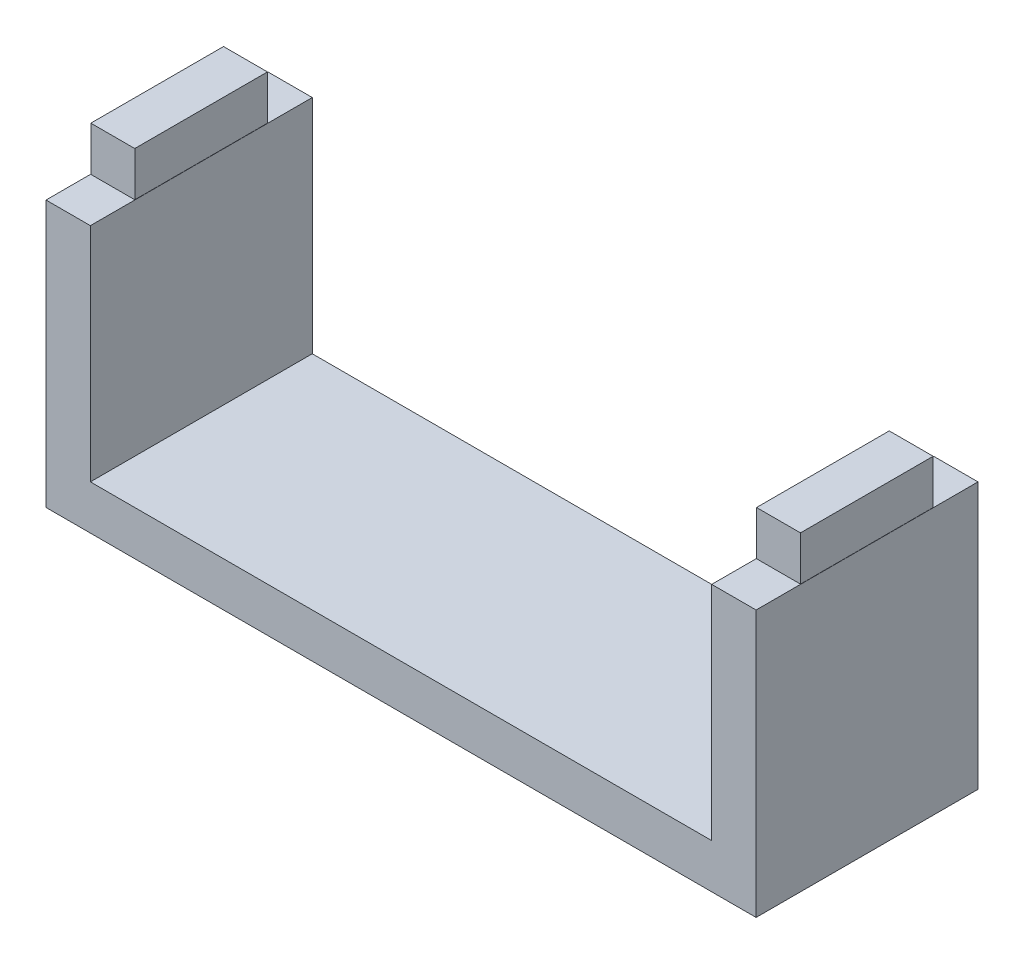
ISO-10303-21;
HEADER;
FILE_DESCRIPTION(('STEP AP214'),'2;1');
FILE_NAME('part.step','',(''),(''),'','','');
FILE_SCHEMA(('AUTOMOTIVE_DESIGN { 1 0 10303 214 1 1 1 1 }'));
ENDSEC;
DATA;
#1=APPLICATION_CONTEXT('core data for automotive mechanical design processes');
#2=APPLICATION_PROTOCOL_DEFINITION('international standard','automotive_design',2000,#1);
#3=PRODUCT_CONTEXT('',#1,'mechanical');
#4=PRODUCT('Part','Part','',(#3));
#5=PRODUCT_RELATED_PRODUCT_CATEGORY('part','',(#4));
#6=PRODUCT_DEFINITION_FORMATION('','',#4);
#7=PRODUCT_DEFINITION_CONTEXT('part definition',#1,'design');
#8=PRODUCT_DEFINITION('design','',#6,#7);
#9=PRODUCT_DEFINITION_SHAPE('','',#8);
#10=(LENGTH_UNIT() NAMED_UNIT(*) SI_UNIT(.MILLI.,.METRE.));
#11=(NAMED_UNIT(*) PLANE_ANGLE_UNIT() SI_UNIT($,.RADIAN.));
#12=(NAMED_UNIT(*) SI_UNIT($,.STERADIAN.) SOLID_ANGLE_UNIT());
#13=UNCERTAINTY_MEASURE_WITH_UNIT(LENGTH_MEASURE(1.E-05),#10,'distance_accuracy_value','');
#14=(GEOMETRIC_REPRESENTATION_CONTEXT(3) GLOBAL_UNCERTAINTY_ASSIGNED_CONTEXT((#13)) GLOBAL_UNIT_ASSIGNED_CONTEXT((#10,
#11,#12)) REPRESENTATION_CONTEXT('',''));
#15=CARTESIAN_POINT('',(0.,0.,0.));
#16=DIRECTION('',(0.,0.,1.));
#17=DIRECTION('',(1.,0.,0.));
#18=AXIS2_PLACEMENT_3D('',#15,#16,#17);
#19=CARTESIAN_POINT('',(0.,60.,0.));
#20=DIRECTION('',(0.,-1.,0.));
#21=DIRECTION('',(0.,0.,-1.));
#22=AXIS2_PLACEMENT_3D('',#19,#20,#21);
#23=PLANE('',#22);
#24=DIRECTION('',(0.,0.,-1.));
#25=VECTOR('',#24,1.);
#26=CARTESIAN_POINT('',(80.0000000000002,60.,-25.));
#27=LINE('',#26,#25);
#28=CARTESIAN_POINT('',(80.0000000000002,60.,25.));
#29=VERTEX_POINT('',#28);
#30=CARTESIAN_POINT('',(80.0000000000002,60.,-25.));
#31=VERTEX_POINT('',#30);
#32=EDGE_CURVE('E225',#29,#31,#27,.T.);
#33=ORIENTED_EDGE('',*,*,#32,.T.);
#34=DIRECTION('',(-1.,0.,0.));
#35=VECTOR('',#34,1.);
#36=CARTESIAN_POINT('',(80.0000000000002,60.,-25.));
#37=LINE('',#36,#35);
#38=CARTESIAN_POINT('',(70.0000000000002,60.,-25.));
#39=VERTEX_POINT('',#38);
#40=EDGE_CURVE('E229',#31,#39,#37,.T.);
#41=ORIENTED_EDGE('',*,*,#40,.T.);
#42=DIRECTION('',(0.,0.,1.));
#43=VECTOR('',#42,1.);
#44=CARTESIAN_POINT('',(70.0000000000002,60.,-25.));
#45=LINE('',#44,#43);
#46=CARTESIAN_POINT('',(70.0000000000001,60.,25.));
#47=VERTEX_POINT('',#46);
#48=EDGE_CURVE('E232',#39,#47,#45,.T.);
#49=ORIENTED_EDGE('',*,*,#48,.T.);
#50=DIRECTION('',(1.,0.,0.));
#51=VECTOR('',#50,1.);
#52=CARTESIAN_POINT('',(80.0000000000002,60.,25.));
#53=LINE('',#52,#51);
#54=EDGE_CURVE('E235',#47,#29,#53,.T.);
#55=ORIENTED_EDGE('',*,*,#54,.T.);
#56=EDGE_LOOP('',(#33,#41,#49,#55));
#57=FACE_BOUND('',#56,.T.);
#58=DIRECTION('',(0.,0.,1.));
#59=VECTOR('',#58,1.);
#60=CARTESIAN_POINT('',(70.0499999999999,60.,14.9499999999999));
#61=LINE('',#60,#59);
#62=CARTESIAN_POINT('',(70.0499999999999,60.,-14.95));
#63=VERTEX_POINT('',#62);
#64=CARTESIAN_POINT('',(70.0499999999999,60.,14.9499999999999));
#65=VERTEX_POINT('',#64);
#66=EDGE_CURVE('E175',#63,#65,#61,.T.);
#67=ORIENTED_EDGE('',*,*,#66,.F.);
#68=DIRECTION('',(-1.,0.,0.));
#69=VECTOR('',#68,1.);
#70=CARTESIAN_POINT('',(70.0499999999999,60.,-14.95));
#71=LINE('',#70,#69);
#72=CARTESIAN_POINT('',(79.9499999999998,60.,-14.95));
#73=VERTEX_POINT('',#72);
#74=EDGE_CURVE('E172',#73,#63,#71,.T.);
#75=ORIENTED_EDGE('',*,*,#74,.F.);
#76=DIRECTION('',(0.,0.,-1.));
#77=VECTOR('',#76,1.);
#78=CARTESIAN_POINT('',(79.9499999999998,60.,14.9499999999999));
#79=LINE('',#78,#77);
#80=CARTESIAN_POINT('',(79.9499999999998,60.,14.9499999999999));
#81=VERTEX_POINT('',#80);
#82=EDGE_CURVE('E60',#81,#73,#79,.T.);
#83=ORIENTED_EDGE('',*,*,#82,.F.);
#84=DIRECTION('',(1.,0.,0.));
#85=VECTOR('',#84,1.);
#86=CARTESIAN_POINT('',(70.0499999999999,60.,14.9499999999999));
#87=LINE('',#86,#85);
#88=EDGE_CURVE('E55',#65,#81,#87,.T.);
#89=ORIENTED_EDGE('',*,*,#88,.F.);
#90=EDGE_LOOP('',(#67,#75,#83,#89));
#91=FACE_BOUND('',#90,.T.);
#92=ADVANCED_FACE('F39',(#57,#91),#23,.F.);
#93=CARTESIAN_POINT('',(0.,60.,0.));
#94=DIRECTION('',(0.,1.,0.));
#95=DIRECTION('',(0.,0.,1.));
#96=AXIS2_PLACEMENT_3D('',#93,#94,#95);
#97=PLANE('',#96);
#98=DIRECTION('',(0.,0.,1.));
#99=VECTOR('',#98,1.);
#100=CARTESIAN_POINT('',(-79.9999999999998,60.,-25.));
#101=LINE('',#100,#99);
#102=CARTESIAN_POINT('',(-79.9999999999998,60.,-25.));
#103=VERTEX_POINT('',#102);
#104=CARTESIAN_POINT('',(-79.9999999999998,60.,25.));
#105=VERTEX_POINT('',#104);
#106=EDGE_CURVE('E251',#103,#105,#101,.T.);
#107=ORIENTED_EDGE('',*,*,#106,.T.);
#108=DIRECTION('',(1.,0.,0.));
#109=VECTOR('',#108,1.);
#110=CARTESIAN_POINT('',(-79.9999999999998,60.,25.));
#111=LINE('',#110,#109);
#112=CARTESIAN_POINT('',(-69.9999999999998,60.,25.));
#113=VERTEX_POINT('',#112);
#114=EDGE_CURVE('E255',#105,#113,#111,.T.);
#115=ORIENTED_EDGE('',*,*,#114,.T.);
#116=DIRECTION('',(0.,0.,-1.));
#117=VECTOR('',#116,1.);
#118=CARTESIAN_POINT('',(-69.9999999999999,60.,-25.));
#119=LINE('',#118,#117);
#120=CARTESIAN_POINT('',(-69.9999999999999,60.,-25.));
#121=VERTEX_POINT('',#120);
#122=EDGE_CURVE('E258',#113,#121,#119,.T.);
#123=ORIENTED_EDGE('',*,*,#122,.T.);
#124=DIRECTION('',(-1.,0.,0.));
#125=VECTOR('',#124,1.);
#126=CARTESIAN_POINT('',(-79.9999999999998,60.,-25.));
#127=LINE('',#126,#125);
#128=EDGE_CURVE('E261',#121,#103,#127,.T.);
#129=ORIENTED_EDGE('',*,*,#128,.T.);
#130=EDGE_LOOP('',(#107,#115,#123,#129));
#131=FACE_BOUND('',#130,.T.);
#132=DIRECTION('',(-1.,0.,0.));
#133=VECTOR('',#132,1.);
#134=CARTESIAN_POINT('',(-70.0499999999999,60.,-14.95));
#135=LINE('',#134,#133);
#136=CARTESIAN_POINT('',(-70.0499999999999,60.,-14.95));
#137=VERTEX_POINT('',#136);
#138=CARTESIAN_POINT('',(-79.9499999999998,60.,-14.95));
#139=VERTEX_POINT('',#138);
#140=EDGE_CURVE('E182',#137,#139,#135,.T.);
#141=ORIENTED_EDGE('',*,*,#140,.F.);
#142=DIRECTION('',(0.,0.,-1.));
#143=VECTOR('',#142,1.);
#144=CARTESIAN_POINT('',(-70.0499999999999,60.,14.95));
#145=LINE('',#144,#143);
#146=CARTESIAN_POINT('',(-70.0499999999999,60.,14.95));
#147=VERTEX_POINT('',#146);
#148=EDGE_CURVE('E177',#147,#137,#145,.T.);
#149=ORIENTED_EDGE('',*,*,#148,.F.);
#150=DIRECTION('',(1.,0.,0.));
#151=VECTOR('',#150,1.);
#152=CARTESIAN_POINT('',(-70.0499999999999,60.,14.95));
#153=LINE('',#152,#151);
#154=CARTESIAN_POINT('',(-79.9499999999998,60.,14.95));
#155=VERTEX_POINT('',#154);
#156=EDGE_CURVE('E193',#155,#147,#153,.T.);
#157=ORIENTED_EDGE('',*,*,#156,.F.);
#158=DIRECTION('',(0.,0.,1.));
#159=VECTOR('',#158,1.);
#160=CARTESIAN_POINT('',(-79.9499999999998,60.,14.95));
#161=LINE('',#160,#159);
#162=EDGE_CURVE('E205',#139,#155,#161,.T.);
#163=ORIENTED_EDGE('',*,*,#162,.F.);
#164=EDGE_LOOP('',(#141,#149,#157,#163));
#165=FACE_BOUND('',#164,.T.);
#166=ADVANCED_FACE('F322',(#131,#165),#97,.T.);
#167=CARTESIAN_POINT('',(0.,10.,0.));
#168=DIRECTION('',(0.,1.,0.));
#169=DIRECTION('',(0.,0.,1.));
#170=AXIS2_PLACEMENT_3D('',#167,#168,#169);
#171=PLANE('',#170);
#172=DIRECTION('',(1.,0.,0.));
#173=VECTOR('',#172,1.);
#174=CARTESIAN_POINT('',(80.0000000000002,10.,25.));
#175=LINE('',#174,#173);
#176=CARTESIAN_POINT('',(-69.9999999999998,10.,25.));
#177=VERTEX_POINT('',#176);
#178=CARTESIAN_POINT('',(70.0000000000001,10.,25.));
#179=VERTEX_POINT('',#178);
#180=EDGE_CURVE('E277',#177,#179,#175,.T.);
#181=ORIENTED_EDGE('',*,*,#180,.T.);
#182=DIRECTION('',(0.,0.,1.));
#183=VECTOR('',#182,1.);
#184=CARTESIAN_POINT('',(70.0000000000002,10.,-25.));
#185=LINE('',#184,#183);
#186=CARTESIAN_POINT('',(70.0000000000001,10.,-25.));
#187=VERTEX_POINT('',#186);
#188=EDGE_CURVE('E224',#187,#179,#185,.T.);
#189=ORIENTED_EDGE('',*,*,#188,.F.);
#190=DIRECTION('',(-1.,0.,0.));
#191=VECTOR('',#190,1.);
#192=CARTESIAN_POINT('',(80.0000000000002,10.,-25.));
#193=LINE('',#192,#191);
#194=CARTESIAN_POINT('',(-69.9999999999999,10.,-25.));
#195=VERTEX_POINT('',#194);
#196=EDGE_CURVE('E280',#187,#195,#193,.T.);
#197=ORIENTED_EDGE('',*,*,#196,.T.);
#198=DIRECTION('',(0.,0.,-1.));
#199=VECTOR('',#198,1.);
#200=CARTESIAN_POINT('',(-69.9999999999999,10.,-25.));
#201=LINE('',#200,#199);
#202=EDGE_CURVE('E250',#177,#195,#201,.T.);
#203=ORIENTED_EDGE('',*,*,#202,.F.);
#204=EDGE_LOOP('',(#181,#189,#197,#203));
#205=FACE_BOUND('',#204,.T.);
#206=ADVANCED_FACE('F333',(#205),#171,.T.);
#207=CARTESIAN_POINT('',(-79.9999999999998,10.,25.));
#208=DIRECTION('',(1.,0.,0.));
#209=DIRECTION('',(0.,0.,-1.));
#210=AXIS2_PLACEMENT_3D('',#207,#208,#209);
#211=PLANE('',#210);
#212=DIRECTION('',(0.,0.,1.));
#213=VECTOR('',#212,1.);
#214=CARTESIAN_POINT('',(-79.9999999999998,0.,25.));
#215=LINE('',#214,#213);
#216=CARTESIAN_POINT('',(-79.9999999999998,0.,-25.));
#217=VERTEX_POINT('',#216);
#218=CARTESIAN_POINT('',(-79.9999999999998,0.,25.));
#219=VERTEX_POINT('',#218);
#220=EDGE_CURVE('E276',#217,#219,#215,.T.);
#221=ORIENTED_EDGE('',*,*,#220,.T.);
#222=DIRECTION('',(0.,-1.,0.));
#223=VECTOR('',#222,1.);
#224=CARTESIAN_POINT('',(-79.9999999999998,10.,25.));
#225=LINE('',#224,#223);
#226=EDGE_CURVE('E11',#105,#219,#225,.T.);
#227=ORIENTED_EDGE('',*,*,#226,.F.);
#228=ORIENTED_EDGE('',*,*,#106,.F.);
#229=DIRECTION('',(0.,-1.,0.));
#230=VECTOR('',#229,1.);
#231=CARTESIAN_POINT('',(-79.9999999999998,10.,-25.));
#232=LINE('',#231,#230);
#233=EDGE_CURVE('E284',#103,#217,#232,.T.);
#234=ORIENTED_EDGE('',*,*,#233,.T.);
#235=EDGE_LOOP('',(#221,#227,#228,#234));
#236=FACE_BOUND('',#235,.T.);
#237=ADVANCED_FACE('F41',(#236),#211,.F.);
#238=CARTESIAN_POINT('',(80.0000000000002,10.,25.));
#239=DIRECTION('',(0.,0.,-1.));
#240=DIRECTION('',(-1.,0.,0.));
#241=AXIS2_PLACEMENT_3D('',#238,#239,#240);
#242=PLANE('',#241);
#243=DIRECTION('',(1.,0.,0.));
#244=VECTOR('',#243,1.);
#245=CARTESIAN_POINT('',(80.0000000000002,0.,25.));
#246=LINE('',#245,#244);
#247=CARTESIAN_POINT('',(80.0000000000002,0.,25.));
#248=VERTEX_POINT('',#247);
#249=EDGE_CURVE('E288',#219,#248,#246,.T.);
#250=ORIENTED_EDGE('',*,*,#249,.T.);
#251=DIRECTION('',(0.,-1.,0.));
#252=VECTOR('',#251,1.);
#253=CARTESIAN_POINT('',(80.0000000000002,10.,25.));
#254=LINE('',#253,#252);
#255=EDGE_CURVE('E48',#29,#248,#254,.T.);
#256=ORIENTED_EDGE('',*,*,#255,.F.);
#257=ORIENTED_EDGE('',*,*,#54,.F.);
#258=DIRECTION('',(0.,-1.,0.));
#259=VECTOR('',#258,1.);
#260=CARTESIAN_POINT('',(70.0000000000001,60.,25.));
#261=LINE('',#260,#259);
#262=EDGE_CURVE('E239',#47,#179,#261,.T.);
#263=ORIENTED_EDGE('',*,*,#262,.T.);
#264=ORIENTED_EDGE('',*,*,#180,.F.);
#265=DIRECTION('',(0.,-1.,0.));
#266=VECTOR('',#265,1.);
#267=CARTESIAN_POINT('',(-69.9999999999998,60.,25.));
#268=LINE('',#267,#266);
#269=EDGE_CURVE('E272',#113,#177,#268,.T.);
#270=ORIENTED_EDGE('',*,*,#269,.F.);
#271=ORIENTED_EDGE('',*,*,#114,.F.);
#272=ORIENTED_EDGE('',*,*,#226,.T.);
#273=EDGE_LOOP('',(#250,#256,#257,#263,#264,#270,#271,#272));
#274=FACE_BOUND('',#273,.T.);
#275=ADVANCED_FACE('F334',(#274),#242,.F.);
#276=CARTESIAN_POINT('',(80.0000000000002,10.,25.));
#277=DIRECTION('',(-1.,0.,0.));
#278=DIRECTION('',(0.,0.,1.));
#279=AXIS2_PLACEMENT_3D('',#276,#277,#278);
#280=PLANE('',#279);
#281=DIRECTION('',(0.,0.,-1.));
#282=VECTOR('',#281,1.);
#283=CARTESIAN_POINT('',(80.0000000000002,0.,25.));
#284=LINE('',#283,#282);
#285=CARTESIAN_POINT('',(80.0000000000002,0.,-25.));
#286=VERTEX_POINT('',#285);
#287=EDGE_CURVE('E291',#248,#286,#284,.T.);
#288=ORIENTED_EDGE('',*,*,#287,.T.);
#289=DIRECTION('',(0.,-1.,0.));
#290=VECTOR('',#289,1.);
#291=CARTESIAN_POINT('',(80.0000000000002,10.,-25.));
#292=LINE('',#291,#290);
#293=EDGE_CURVE('E299',#31,#286,#292,.T.);
#294=ORIENTED_EDGE('',*,*,#293,.F.);
#295=ORIENTED_EDGE('',*,*,#32,.F.);
#296=ORIENTED_EDGE('',*,*,#255,.T.);
#297=EDGE_LOOP('',(#288,#294,#295,#296));
#298=FACE_BOUND('',#297,.T.);
#299=ADVANCED_FACE('F307',(#298),#280,.F.);
#300=CARTESIAN_POINT('',(80.0000000000002,10.,-25.));
#301=DIRECTION('',(0.,0.,1.));
#302=DIRECTION('',(1.,0.,0.));
#303=AXIS2_PLACEMENT_3D('',#300,#301,#302);
#304=PLANE('',#303);
#305=DIRECTION('',(-1.,0.,0.));
#306=VECTOR('',#305,1.);
#307=CARTESIAN_POINT('',(80.0000000000002,0.,-25.));
#308=LINE('',#307,#306);
#309=EDGE_CURVE('E281',#286,#217,#308,.T.);
#310=ORIENTED_EDGE('',*,*,#309,.T.);
#311=ORIENTED_EDGE('',*,*,#233,.F.);
#312=ORIENTED_EDGE('',*,*,#128,.F.);
#313=DIRECTION('',(0.,-1.,0.));
#314=VECTOR('',#313,1.);
#315=CARTESIAN_POINT('',(-69.9999999999999,60.,-25.));
#316=LINE('',#315,#314);
#317=EDGE_CURVE('E265',#121,#195,#316,.T.);
#318=ORIENTED_EDGE('',*,*,#317,.T.);
#319=ORIENTED_EDGE('',*,*,#196,.F.);
#320=DIRECTION('',(0.,-1.,0.));
#321=VECTOR('',#320,1.);
#322=CARTESIAN_POINT('',(70.0000000000002,60.,-25.));
#323=LINE('',#322,#321);
#324=EDGE_CURVE('E246',#39,#187,#323,.T.);
#325=ORIENTED_EDGE('',*,*,#324,.F.);
#326=ORIENTED_EDGE('',*,*,#40,.F.);
#327=ORIENTED_EDGE('',*,*,#293,.T.);
#328=EDGE_LOOP('',(#310,#311,#312,#318,#319,#325,#326,#327));
#329=FACE_BOUND('',#328,.T.);
#330=ADVANCED_FACE('F315',(#329),#304,.F.);
#331=CARTESIAN_POINT('',(0.,0.,0.));
#332=DIRECTION('',(0.,1.,0.));
#333=DIRECTION('',(0.,0.,1.));
#334=AXIS2_PLACEMENT_3D('',#331,#332,#333);
#335=PLANE('',#334);
#336=ORIENTED_EDGE('',*,*,#220,.F.);
#337=ORIENTED_EDGE('',*,*,#309,.F.);
#338=ORIENTED_EDGE('',*,*,#287,.F.);
#339=ORIENTED_EDGE('',*,*,#249,.F.);
#340=EDGE_LOOP('',(#336,#337,#338,#339));
#341=FACE_BOUND('',#340,.T.);
#342=ADVANCED_FACE('F313',(#341),#335,.F.);
#343=CARTESIAN_POINT('',(-69.9999999999999,60.,-25.));
#344=DIRECTION('',(-1.,0.,0.));
#345=DIRECTION('',(0.,0.,1.));
#346=AXIS2_PLACEMENT_3D('',#343,#344,#345);
#347=PLANE('',#346);
#348=ORIENTED_EDGE('',*,*,#202,.T.);
#349=ORIENTED_EDGE('',*,*,#317,.F.);
#350=ORIENTED_EDGE('',*,*,#122,.F.);
#351=ORIENTED_EDGE('',*,*,#269,.T.);
#352=EDGE_LOOP('',(#348,#349,#350,#351));
#353=FACE_BOUND('',#352,.T.);
#354=ADVANCED_FACE('F330',(#353),#347,.F.);
#355=CARTESIAN_POINT('',(70.0000000000002,60.,-25.));
#356=DIRECTION('',(1.,0.,0.));
#357=DIRECTION('',(0.,0.,-1.));
#358=AXIS2_PLACEMENT_3D('',#355,#356,#357);
#359=PLANE('',#358);
#360=ORIENTED_EDGE('',*,*,#188,.T.);
#361=ORIENTED_EDGE('',*,*,#262,.F.);
#362=ORIENTED_EDGE('',*,*,#48,.F.);
#363=ORIENTED_EDGE('',*,*,#324,.T.);
#364=EDGE_LOOP('',(#360,#361,#362,#363));
#365=FACE_BOUND('',#364,.T.);
#366=ADVANCED_FACE('F338',(#365),#359,.F.);
#367=CARTESIAN_POINT('',(-70.0499999999999,70.,14.95));
#368=DIRECTION('',(-1.,0.,0.));
#369=DIRECTION('',(0.,0.,1.));
#370=AXIS2_PLACEMENT_3D('',#367,#368,#369);
#371=PLANE('',#370);
#372=ORIENTED_EDGE('',*,*,#148,.T.);
#373=DIRECTION('',(0.,-1.,0.));
#374=VECTOR('',#373,1.);
#375=CARTESIAN_POINT('',(-70.0499999999999,70.,-14.95));
#376=LINE('',#375,#374);
#377=CARTESIAN_POINT('',(-70.0499999999999,70.,-14.95));
#378=VERTEX_POINT('',#377);
#379=EDGE_CURVE('E221',#378,#137,#376,.T.);
#380=ORIENTED_EDGE('',*,*,#379,.F.);
#381=DIRECTION('',(0.,0.,-1.));
#382=VECTOR('',#381,1.);
#383=CARTESIAN_POINT('',(-70.0499999999999,70.,14.95));
#384=LINE('',#383,#382);
#385=CARTESIAN_POINT('',(-70.0499999999999,70.,14.95));
#386=VERTEX_POINT('',#385);
#387=EDGE_CURVE('E188',#386,#378,#384,.T.);
#388=ORIENTED_EDGE('',*,*,#387,.F.);
#389=DIRECTION('',(0.,-1.,0.));
#390=VECTOR('',#389,1.);
#391=CARTESIAN_POINT('',(-70.0499999999999,70.,14.95));
#392=LINE('',#391,#390);
#393=EDGE_CURVE('E201',#386,#147,#392,.T.);
#394=ORIENTED_EDGE('',*,*,#393,.T.);
#395=EDGE_LOOP('',(#372,#380,#388,#394));
#396=FACE_BOUND('',#395,.T.);
#397=ADVANCED_FACE('F392',(#396),#371,.F.);
#398=CARTESIAN_POINT('',(-70.0499999999999,70.,-14.95));
#399=DIRECTION('',(0.,0.,1.));
#400=DIRECTION('',(1.,0.,0.));
#401=AXIS2_PLACEMENT_3D('',#398,#399,#400);
#402=PLANE('',#401);
#403=ORIENTED_EDGE('',*,*,#140,.T.);
#404=DIRECTION('',(0.,-1.,0.));
#405=VECTOR('',#404,1.);
#406=CARTESIAN_POINT('',(-79.9499999999998,70.,-14.95));
#407=LINE('',#406,#405);
#408=CARTESIAN_POINT('',(-79.9499999999998,70.,-14.95));
#409=VERTEX_POINT('',#408);
#410=EDGE_CURVE('E217',#409,#139,#407,.T.);
#411=ORIENTED_EDGE('',*,*,#410,.F.);
#412=DIRECTION('',(-1.,0.,0.));
#413=VECTOR('',#412,1.);
#414=CARTESIAN_POINT('',(-70.0499999999999,70.,-14.95));
#415=LINE('',#414,#413);
#416=EDGE_CURVE('E192',#378,#409,#415,.T.);
#417=ORIENTED_EDGE('',*,*,#416,.F.);
#418=ORIENTED_EDGE('',*,*,#379,.T.);
#419=EDGE_LOOP('',(#403,#411,#417,#418));
#420=FACE_BOUND('',#419,.T.);
#421=ADVANCED_FACE('F388',(#420),#402,.F.);
#422=CARTESIAN_POINT('',(-79.9499999999998,70.,14.95));
#423=DIRECTION('',(1.,0.,0.));
#424=DIRECTION('',(0.,0.,-1.));
#425=AXIS2_PLACEMENT_3D('',#422,#423,#424);
#426=PLANE('',#425);
#427=ORIENTED_EDGE('',*,*,#162,.T.);
#428=DIRECTION('',(0.,-1.,0.));
#429=VECTOR('',#428,1.);
#430=CARTESIAN_POINT('',(-79.9499999999998,70.,14.95));
#431=LINE('',#430,#429);
#432=CARTESIAN_POINT('',(-79.9499999999998,70.,14.95));
#433=VERTEX_POINT('',#432);
#434=EDGE_CURVE('E214',#433,#155,#431,.T.);
#435=ORIENTED_EDGE('',*,*,#434,.F.);
#436=DIRECTION('',(0.,0.,1.));
#437=VECTOR('',#436,1.);
#438=CARTESIAN_POINT('',(-79.9499999999998,70.,14.95));
#439=LINE('',#438,#437);
#440=EDGE_CURVE('E196',#409,#433,#439,.T.);
#441=ORIENTED_EDGE('',*,*,#440,.F.);
#442=ORIENTED_EDGE('',*,*,#410,.T.);
#443=EDGE_LOOP('',(#427,#435,#441,#442));
#444=FACE_BOUND('',#443,.T.);
#445=ADVANCED_FACE('F384',(#444),#426,.F.);
#446=CARTESIAN_POINT('',(-70.0499999999999,70.,14.95));
#447=DIRECTION('',(0.,0.,-1.));
#448=DIRECTION('',(-1.,0.,0.));
#449=AXIS2_PLACEMENT_3D('',#446,#447,#448);
#450=PLANE('',#449);
#451=ORIENTED_EDGE('',*,*,#156,.T.);
#452=ORIENTED_EDGE('',*,*,#393,.F.);
#453=DIRECTION('',(1.,0.,0.));
#454=VECTOR('',#453,1.);
#455=CARTESIAN_POINT('',(-70.0499999999999,70.,14.95));
#456=LINE('',#455,#454);
#457=EDGE_CURVE('E199',#433,#386,#456,.T.);
#458=ORIENTED_EDGE('',*,*,#457,.F.);
#459=ORIENTED_EDGE('',*,*,#434,.T.);
#460=EDGE_LOOP('',(#451,#452,#458,#459));
#461=FACE_BOUND('',#460,.T.);
#462=ADVANCED_FACE('F380',(#461),#450,.F.);
#463=CARTESIAN_POINT('',(0.,70.,0.));
#464=DIRECTION('',(0.,1.,0.));
#465=DIRECTION('',(0.,0.,1.));
#466=AXIS2_PLACEMENT_3D('',#463,#464,#465);
#467=PLANE('',#466);
#468=ORIENTED_EDGE('',*,*,#387,.T.);
#469=ORIENTED_EDGE('',*,*,#416,.T.);
#470=ORIENTED_EDGE('',*,*,#440,.T.);
#471=ORIENTED_EDGE('',*,*,#457,.T.);
#472=EDGE_LOOP('',(#468,#469,#470,#471));
#473=FACE_BOUND('',#472,.T.);
#474=ADVANCED_FACE('F377',(#473),#467,.T.);
#475=CARTESIAN_POINT('',(70.0499999999999,70.,14.9499999999999));
#476=DIRECTION('',(1.,0.,0.));
#477=DIRECTION('',(0.,0.,-1.));
#478=AXIS2_PLACEMENT_3D('',#475,#476,#477);
#479=PLANE('',#478);
#480=ORIENTED_EDGE('',*,*,#66,.T.);
#481=DIRECTION('',(0.,-1.,0.));
#482=VECTOR('',#481,1.);
#483=CARTESIAN_POINT('',(70.0499999999999,70.,14.9499999999999));
#484=LINE('',#483,#482);
#485=CARTESIAN_POINT('',(70.0499999999999,70.,14.9499999999999));
#486=VERTEX_POINT('',#485);
#487=EDGE_CURVE('E154',#486,#65,#484,.T.);
#488=ORIENTED_EDGE('',*,*,#487,.F.);
#489=DIRECTION('',(0.,0.,1.));
#490=VECTOR('',#489,1.);
#491=CARTESIAN_POINT('',(70.0499999999999,70.,14.9499999999999));
#492=LINE('',#491,#490);
#493=CARTESIAN_POINT('',(70.0499999999999,70.,-14.95));
#494=VERTEX_POINT('',#493);
#495=EDGE_CURVE('E162',#494,#486,#492,.T.);
#496=ORIENTED_EDGE('',*,*,#495,.F.);
#497=DIRECTION('',(0.,-1.,0.));
#498=VECTOR('',#497,1.);
#499=CARTESIAN_POINT('',(70.0499999999999,70.,-14.95));
#500=LINE('',#499,#498);
#501=EDGE_CURVE('E348',#494,#63,#500,.T.);
#502=ORIENTED_EDGE('',*,*,#501,.T.);
#503=EDGE_LOOP('',(#480,#488,#496,#502));
#504=FACE_BOUND('',#503,.T.);
#505=ADVANCED_FACE('F174',(#504),#479,.F.);
#506=CARTESIAN_POINT('',(70.0499999999999,70.,14.9499999999999));
#507=DIRECTION('',(0.,0.,-1.));
#508=DIRECTION('',(-1.,0.,0.));
#509=AXIS2_PLACEMENT_3D('',#506,#507,#508);
#510=PLANE('',#509);
#511=ORIENTED_EDGE('',*,*,#88,.T.);
#512=DIRECTION('',(0.,-1.,0.));
#513=VECTOR('',#512,1.);
#514=CARTESIAN_POINT('',(79.9499999999998,70.,14.9499999999999));
#515=LINE('',#514,#513);
#516=CARTESIAN_POINT('',(79.9499999999998,70.,14.9499999999999));
#517=VERTEX_POINT('',#516);
#518=EDGE_CURVE('E157',#517,#81,#515,.T.);
#519=ORIENTED_EDGE('',*,*,#518,.F.);
#520=DIRECTION('',(1.,0.,0.));
#521=VECTOR('',#520,1.);
#522=CARTESIAN_POINT('',(70.0499999999999,70.,14.9499999999999));
#523=LINE('',#522,#521);
#524=EDGE_CURVE('E150',#486,#517,#523,.T.);
#525=ORIENTED_EDGE('',*,*,#524,.F.);
#526=ORIENTED_EDGE('',*,*,#487,.T.);
#527=EDGE_LOOP('',(#511,#519,#525,#526));
#528=FACE_BOUND('',#527,.T.);
#529=ADVANCED_FACE('F152',(#528),#510,.F.);
#530=CARTESIAN_POINT('',(79.9499999999998,70.,14.9499999999999));
#531=DIRECTION('',(-1.,0.,0.));
#532=DIRECTION('',(0.,0.,1.));
#533=AXIS2_PLACEMENT_3D('',#530,#531,#532);
#534=PLANE('',#533);
#535=ORIENTED_EDGE('',*,*,#82,.T.);
#536=DIRECTION('',(0.,-1.,0.));
#537=VECTOR('',#536,1.);
#538=CARTESIAN_POINT('',(79.9499999999998,70.,-14.95));
#539=LINE('',#538,#537);
#540=CARTESIAN_POINT('',(79.9499999999998,70.,-14.95));
#541=VERTEX_POINT('',#540);
#542=EDGE_CURVE('E184',#541,#73,#539,.T.);
#543=ORIENTED_EDGE('',*,*,#542,.F.);
#544=DIRECTION('',(0.,0.,-1.));
#545=VECTOR('',#544,1.);
#546=CARTESIAN_POINT('',(79.9499999999998,70.,14.9499999999999));
#547=LINE('',#546,#545);
#548=EDGE_CURVE('E161',#517,#541,#547,.T.);
#549=ORIENTED_EDGE('',*,*,#548,.F.);
#550=ORIENTED_EDGE('',*,*,#518,.T.);
#551=EDGE_LOOP('',(#535,#543,#549,#550));
#552=FACE_BOUND('',#551,.T.);
#553=ADVANCED_FACE('F364',(#552),#534,.F.);
#554=CARTESIAN_POINT('',(70.0499999999999,70.,-14.95));
#555=DIRECTION('',(0.,0.,1.));
#556=DIRECTION('',(1.,0.,0.));
#557=AXIS2_PLACEMENT_3D('',#554,#555,#556);
#558=PLANE('',#557);
#559=ORIENTED_EDGE('',*,*,#74,.T.);
#560=ORIENTED_EDGE('',*,*,#501,.F.);
#561=DIRECTION('',(-1.,0.,0.));
#562=VECTOR('',#561,1.);
#563=CARTESIAN_POINT('',(70.0499999999999,70.,-14.95));
#564=LINE('',#563,#562);
#565=EDGE_CURVE('E167',#541,#494,#564,.T.);
#566=ORIENTED_EDGE('',*,*,#565,.F.);
#567=ORIENTED_EDGE('',*,*,#542,.T.);
#568=EDGE_LOOP('',(#559,#560,#566,#567));
#569=FACE_BOUND('',#568,.T.);
#570=ADVANCED_FACE('F347',(#569),#558,.F.);
#571=CARTESIAN_POINT('',(0.,70.,0.));
#572=DIRECTION('',(0.,-1.,0.));
#573=DIRECTION('',(0.,0.,-1.));
#574=AXIS2_PLACEMENT_3D('',#571,#572,#573);
#575=PLANE('',#574);
#576=ORIENTED_EDGE('',*,*,#495,.T.);
#577=ORIENTED_EDGE('',*,*,#524,.T.);
#578=ORIENTED_EDGE('',*,*,#548,.T.);
#579=ORIENTED_EDGE('',*,*,#565,.T.);
#580=EDGE_LOOP('',(#576,#577,#578,#579));
#581=FACE_BOUND('',#580,.T.);
#582=ADVANCED_FACE('F165',(#581),#575,.F.);
#583=CLOSED_SHELL('',(#92,#166,#206,#237,#275,#299,#330,#342,#354,#366,#397,#421,#445,#462,#474,
#505,#529,#553,#570,#582));
#584=MANIFOLD_SOLID_BREP('B2',#583);
#585=ADVANCED_BREP_SHAPE_REPRESENTATION('',(#18,#584),#14);
#586=SHAPE_DEFINITION_REPRESENTATION(#9,#585);
ENDSEC;
END-ISO-10303-21;
